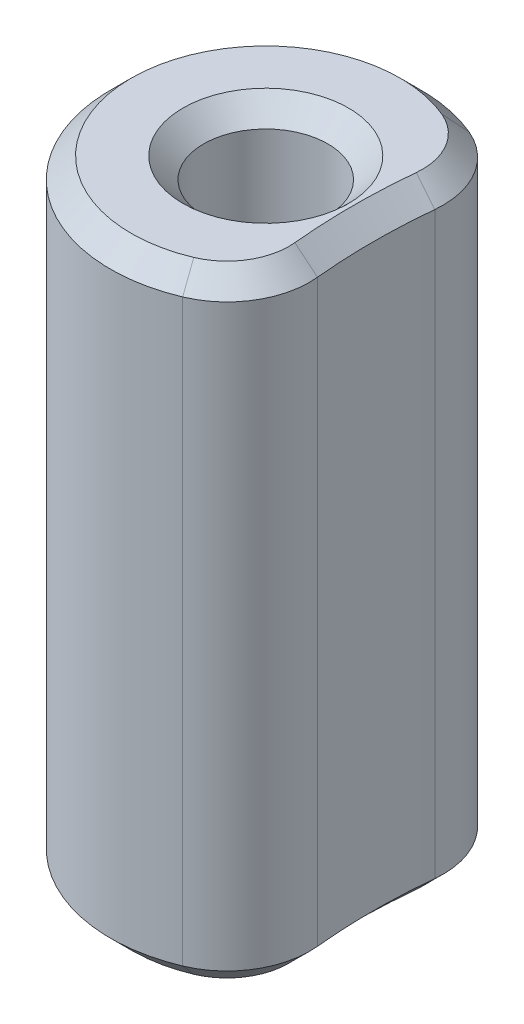
ISO-10303-21;
HEADER;
FILE_DESCRIPTION(('STEP AP214'),'2;1');
FILE_NAME('part.step','',(''),(''),'','','');
FILE_SCHEMA(('AUTOMOTIVE_DESIGN { 1 0 10303 214 1 1 1 1 }'));
ENDSEC;
DATA;
#1=APPLICATION_CONTEXT('core data for automotive mechanical design processes');
#2=APPLICATION_PROTOCOL_DEFINITION('international standard','automotive_design',2000,#1);
#3=PRODUCT_CONTEXT('',#1,'mechanical');
#4=PRODUCT('Part','Part','',(#3));
#5=PRODUCT_RELATED_PRODUCT_CATEGORY('part','',(#4));
#6=PRODUCT_DEFINITION_FORMATION('','',#4);
#7=PRODUCT_DEFINITION_CONTEXT('part definition',#1,'design');
#8=PRODUCT_DEFINITION('design','',#6,#7);
#9=PRODUCT_DEFINITION_SHAPE('','',#8);
#10=(LENGTH_UNIT() NAMED_UNIT(*) SI_UNIT(.MILLI.,.METRE.));
#11=(NAMED_UNIT(*) PLANE_ANGLE_UNIT() SI_UNIT($,.RADIAN.));
#12=(NAMED_UNIT(*) SI_UNIT($,.STERADIAN.) SOLID_ANGLE_UNIT());
#13=UNCERTAINTY_MEASURE_WITH_UNIT(LENGTH_MEASURE(1.E-05),#10,'distance_accuracy_value','');
#14=(GEOMETRIC_REPRESENTATION_CONTEXT(3) GLOBAL_UNCERTAINTY_ASSIGNED_CONTEXT((#13)) GLOBAL_UNIT_ASSIGNED_CONTEXT((#10,
#11,#12)) REPRESENTATION_CONTEXT('',''));
#15=CARTESIAN_POINT('',(0.,0.,0.));
#16=DIRECTION('',(0.,0.,1.));
#17=DIRECTION('',(1.,0.,0.));
#18=AXIS2_PLACEMENT_3D('',#15,#16,#17);
#19=CARTESIAN_POINT('',(10.776307345283,9.525,0.));
#20=DIRECTION('',(0.,1.,0.));
#21=DIRECTION('',(0.,0.,1.));
#22=AXIS2_PLACEMENT_3D('',#19,#20,#21);
#23=PLANE('',#22);
#24=CARTESIAN_POINT('',(0.,9.525,0.));
#25=DIRECTION('',(0.,1.,0.));
#26=DIRECTION('',(0.,0.,1.));
#27=AXIS2_PLACEMENT_3D('',#24,#25,#26);
#28=CIRCLE('',#27,2.54000000000001);
#29=CARTESIAN_POINT('',(0.,9.525,2.54000000000001));
#30=VERTEX_POINT('',#29);
#31=EDGE_CURVE('E11',#30,#30,#28,.F.);
#32=ORIENTED_EDGE('',*,*,#31,.T.);
#33=EDGE_LOOP('',(#32));
#34=FACE_BOUND('',#33,.T.);
#35=CARTESIAN_POINT('',(0.,9.525,0.));
#36=DIRECTION('',(0.,1.,0.));
#37=DIRECTION('',(0.,0.,1.));
#38=AXIS2_PLACEMENT_3D('',#35,#36,#37);
#39=CIRCLE('',#38,4.12750000000001);
#40=CARTESIAN_POINT('',(1.59687457272017,9.525,-3.80608037868354));
#41=VERTEX_POINT('',#40);
#42=CARTESIAN_POINT('',(1.59687457272017,9.525,3.80608037868354));
#43=VERTEX_POINT('',#42);
#44=EDGE_CURVE('E60',#41,#43,#39,.T.);
#45=ORIENTED_EDGE('',*,*,#44,.T.);
#46=CARTESIAN_POINT('',(0.85985553915701,9.525,2.04942789621421));
#47=DIRECTION('',(0.,1.,0.));
#48=DIRECTION('',(0.,0.,1.));
#49=AXIS2_PLACEMENT_3D('',#46,#47,#48);
#50=CIRCLE('',#49,1.90500000000001);
#51=CARTESIAN_POINT('',(2.75558056481029,9.525,1.86167372951766));
#52=VERTEX_POINT('',#51);
#53=EDGE_CURVE('E52',#43,#52,#50,.T.);
#54=ORIENTED_EDGE('',*,*,#53,.T.);
#55=CARTESIAN_POINT('',(21.552614690566,9.525,0.));
#56=DIRECTION('',(0.,1.,0.));
#57=DIRECTION('',(0.,0.,1.));
#58=AXIS2_PLACEMENT_3D('',#55,#56,#57);
#59=CIRCLE('',#58,18.889);
#60=CARTESIAN_POINT('',(2.75558056481029,9.525,-1.86167372951766));
#61=VERTEX_POINT('',#60);
#62=EDGE_CURVE('E180',#52,#61,#59,.F.);
#63=ORIENTED_EDGE('',*,*,#62,.T.);
#64=CARTESIAN_POINT('',(0.85985553915701,9.525,-2.04942789621421));
#65=DIRECTION('',(0.,1.,0.));
#66=DIRECTION('',(0.,0.,1.));
#67=AXIS2_PLACEMENT_3D('',#64,#65,#66);
#68=CIRCLE('',#67,1.90500000000001);
#69=EDGE_CURVE('E65',#61,#41,#68,.T.);
#70=ORIENTED_EDGE('',*,*,#69,.T.);
#71=EDGE_LOOP('',(#45,#54,#63,#70));
#72=FACE_BOUND('',#71,.T.);
#73=ADVANCED_FACE('F41',(#34,#72),#23,.T.);
#74=CARTESIAN_POINT('',(10.776307345283,-9.525,0.));
#75=DIRECTION('',(0.,1.,0.));
#76=DIRECTION('',(0.,0.,1.));
#77=AXIS2_PLACEMENT_3D('',#74,#75,#76);
#78=PLANE('',#77);
#79=CARTESIAN_POINT('',(0.,-9.525,0.));
#80=DIRECTION('',(0.,1.,0.));
#81=DIRECTION('',(0.,0.,1.));
#82=AXIS2_PLACEMENT_3D('',#79,#80,#81);
#83=CIRCLE('',#82,2.53999999999999);
#84=CARTESIAN_POINT('',(0.,-9.525,2.53999999999999));
#85=VERTEX_POINT('',#84);
#86=EDGE_CURVE('E139',#85,#85,#83,.T.);
#87=ORIENTED_EDGE('',*,*,#86,.T.);
#88=EDGE_LOOP('',(#87));
#89=FACE_BOUND('',#88,.T.);
#90=CARTESIAN_POINT('',(21.552614690566,-9.525,0.));
#91=DIRECTION('',(0.,1.,0.));
#92=DIRECTION('',(0.,0.,1.));
#93=AXIS2_PLACEMENT_3D('',#90,#91,#92);
#94=CIRCLE('',#93,18.889);
#95=CARTESIAN_POINT('',(2.75558056481026,-9.525,-1.86167372951766));
#96=VERTEX_POINT('',#95);
#97=CARTESIAN_POINT('',(2.75558056481026,-9.525,1.86167372951766));
#98=VERTEX_POINT('',#97);
#99=EDGE_CURVE('E136',#96,#98,#94,.T.);
#100=ORIENTED_EDGE('',*,*,#99,.T.);
#101=CARTESIAN_POINT('',(0.85985553915701,-9.525,2.04942789621421));
#102=DIRECTION('',(0.,1.,0.));
#103=DIRECTION('',(0.,0.,1.));
#104=AXIS2_PLACEMENT_3D('',#101,#102,#103);
#105=CIRCLE('',#104,1.90499999999998);
#106=CARTESIAN_POINT('',(1.59687457272015,-9.525,3.80608037868351));
#107=VERTEX_POINT('',#106);
#108=EDGE_CURVE('E115',#98,#107,#105,.F.);
#109=ORIENTED_EDGE('',*,*,#108,.T.);
#110=CARTESIAN_POINT('',(0.,-9.525,0.));
#111=DIRECTION('',(0.,1.,0.));
#112=DIRECTION('',(0.,0.,1.));
#113=AXIS2_PLACEMENT_3D('',#110,#111,#112);
#114=CIRCLE('',#113,4.12749999999998);
#115=CARTESIAN_POINT('',(1.59687457272015,-9.525,-3.80608037868351));
#116=VERTEX_POINT('',#115);
#117=EDGE_CURVE('E124',#107,#116,#114,.F.);
#118=ORIENTED_EDGE('',*,*,#117,.T.);
#119=CARTESIAN_POINT('',(0.85985553915701,-9.525,-2.04942789621421));
#120=DIRECTION('',(0.,1.,0.));
#121=DIRECTION('',(0.,0.,1.));
#122=AXIS2_PLACEMENT_3D('',#119,#120,#121);
#123=CIRCLE('',#122,1.90499999999998);
#124=EDGE_CURVE('E131',#116,#96,#123,.F.);
#125=ORIENTED_EDGE('',*,*,#124,.T.);
#126=EDGE_LOOP('',(#100,#109,#118,#125));
#127=FACE_BOUND('',#126,.T.);
#128=ADVANCED_FACE('F134',(#89,#127),#78,.F.);
#129=CARTESIAN_POINT('',(0.,9.525,0.));
#130=DIRECTION('',(0.,-1.,0.));
#131=DIRECTION('',(0.,0.,-1.));
#132=AXIS2_PLACEMENT_3D('',#129,#130,#131);
#133=CYLINDRICAL_SURFACE('',#132,4.7625);
#134=DIRECTION('',(0.,-1.,0.));
#135=VECTOR('',#134,1.);
#136=CARTESIAN_POINT('',(1.84254758390788,9.525,-4.39163120617331));
#137=LINE('',#136,#135);
#138=CARTESIAN_POINT('',(1.84254758390788,8.89000000000001,-4.39163120617331));
#139=VERTEX_POINT('',#138);
#140=CARTESIAN_POINT('',(1.84254758390788,-8.88999999999997,-4.39163120617331));
#141=VERTEX_POINT('',#140);
#142=EDGE_CURVE('E224',#139,#141,#137,.T.);
#143=ORIENTED_EDGE('',*,*,#142,.T.);
#144=CARTESIAN_POINT('',(0.,-8.88999999999998,0.));
#145=DIRECTION('',(0.,1.,0.));
#146=DIRECTION('',(0.,0.,1.));
#147=AXIS2_PLACEMENT_3D('',#144,#145,#146);
#148=CIRCLE('',#147,4.7625);
#149=CARTESIAN_POINT('',(1.84254758390788,-8.88999999999997,4.39163120617331));
#150=VERTEX_POINT('',#149);
#151=EDGE_CURVE('E177',#141,#150,#148,.T.);
#152=ORIENTED_EDGE('',*,*,#151,.T.);
#153=DIRECTION('',(0.,-1.,0.));
#154=VECTOR('',#153,1.);
#155=CARTESIAN_POINT('',(1.84254758390788,9.525,4.39163120617331));
#156=LINE('',#155,#154);
#157=CARTESIAN_POINT('',(1.84254758390788,8.89000000000001,4.39163120617331));
#158=VERTEX_POINT('',#157);
#159=EDGE_CURVE('E197',#150,#158,#156,.F.);
#160=ORIENTED_EDGE('',*,*,#159,.T.);
#161=CARTESIAN_POINT('',(0.,8.89000000000001,0.));
#162=DIRECTION('',(0.,1.,0.));
#163=DIRECTION('',(0.,0.,1.));
#164=AXIS2_PLACEMENT_3D('',#161,#162,#163);
#165=CIRCLE('',#164,4.7625);
#166=EDGE_CURVE('E174',#158,#139,#165,.F.);
#167=ORIENTED_EDGE('',*,*,#166,.T.);
#168=EDGE_LOOP('',(#143,#152,#160,#167));
#169=FACE_BOUND('',#168,.T.);
#170=ADVANCED_FACE('F251',(#169),#133,.T.);
#171=CARTESIAN_POINT('',(21.552614690566,9.525,0.));
#172=DIRECTION('',(0.,-1.,0.));
#173=DIRECTION('',(0.,0.,-1.));
#174=AXIS2_PLACEMENT_3D('',#171,#172,#173);
#175=CYLINDRICAL_SURFACE('',#174,18.254);
#176=DIRECTION('',(0.,-1.,0.));
#177=VECTOR('',#176,1.);
#178=CARTESIAN_POINT('',(3.3874889066947,9.525,1.79908900728548));
#179=LINE('',#178,#177);
#180=CARTESIAN_POINT('',(3.3874889066947,8.89000000000001,1.79908900728548));
#181=VERTEX_POINT('',#180);
#182=CARTESIAN_POINT('',(3.3874889066947,-8.88999999999997,1.79908900728548));
#183=VERTEX_POINT('',#182);
#184=EDGE_CURVE('E231',#181,#183,#179,.T.);
#185=ORIENTED_EDGE('',*,*,#184,.T.);
#186=CARTESIAN_POINT('',(21.552614690566,-8.88999999999998,0.));
#187=DIRECTION('',(0.,1.,0.));
#188=DIRECTION('',(0.,0.,1.));
#189=AXIS2_PLACEMENT_3D('',#186,#187,#188);
#190=CIRCLE('',#189,18.254);
#191=CARTESIAN_POINT('',(3.3874889066947,-8.88999999999997,-1.79908900728548));
#192=VERTEX_POINT('',#191);
#193=EDGE_CURVE('E165',#183,#192,#190,.F.);
#194=ORIENTED_EDGE('',*,*,#193,.T.);
#195=DIRECTION('',(0.,-1.,0.));
#196=VECTOR('',#195,1.);
#197=CARTESIAN_POINT('',(3.3874889066947,9.525,-1.79908900728548));
#198=LINE('',#197,#196);
#199=CARTESIAN_POINT('',(3.3874889066947,8.89000000000001,-1.79908900728548));
#200=VERTEX_POINT('',#199);
#201=EDGE_CURVE('E132',#192,#200,#198,.F.);
#202=ORIENTED_EDGE('',*,*,#201,.T.);
#203=CARTESIAN_POINT('',(21.552614690566,8.89000000000001,0.));
#204=DIRECTION('',(0.,1.,0.));
#205=DIRECTION('',(0.,0.,1.));
#206=AXIS2_PLACEMENT_3D('',#203,#204,#205);
#207=CIRCLE('',#206,18.254);
#208=EDGE_CURVE('E162',#200,#181,#207,.T.);
#209=ORIENTED_EDGE('',*,*,#208,.T.);
#210=EDGE_LOOP('',(#185,#194,#202,#209));
#211=FACE_BOUND('',#210,.T.);
#212=ADVANCED_FACE('F227',(#211),#175,.F.);
#213=CARTESIAN_POINT('',(0.,9.525,0.));
#214=DIRECTION('',(0.,-1.,0.));
#215=DIRECTION('',(0.,0.,-1.));
#216=AXIS2_PLACEMENT_3D('',#213,#214,#215);
#217=CYLINDRICAL_SURFACE('',#216,1.905);
#218=CARTESIAN_POINT('',(0.,-8.89,0.));
#219=DIRECTION('',(0.,1.,0.));
#220=DIRECTION('',(0.,0.,1.));
#221=AXIS2_PLACEMENT_3D('',#218,#219,#220);
#222=CIRCLE('',#221,1.905);
#223=CARTESIAN_POINT('',(0.,-8.89,1.905));
#224=VERTEX_POINT('',#223);
#225=EDGE_CURVE('E152',#224,#224,#222,.F.);
#226=ORIENTED_EDGE('',*,*,#225,.T.);
#227=EDGE_LOOP('',(#226));
#228=FACE_BOUND('',#227,.T.);
#229=CARTESIAN_POINT('',(0.,8.88999999999999,0.));
#230=DIRECTION('',(0.,1.,0.));
#231=DIRECTION('',(0.,0.,1.));
#232=AXIS2_PLACEMENT_3D('',#229,#230,#231);
#233=CIRCLE('',#232,1.905);
#234=CARTESIAN_POINT('',(0.,8.88999999999999,1.905));
#235=VERTEX_POINT('',#234);
#236=EDGE_CURVE('E144',#235,#235,#233,.T.);
#237=ORIENTED_EDGE('',*,*,#236,.T.);
#238=EDGE_LOOP('',(#237));
#239=FACE_BOUND('',#238,.T.);
#240=ADVANCED_FACE('F258',(#228,#239),#217,.F.);
#241=CARTESIAN_POINT('',(0.85985553915701,9.525,-2.04942789621421));
#242=DIRECTION('',(0.,1.,0.));
#243=DIRECTION('',(0.,0.,1.));
#244=AXIS2_PLACEMENT_3D('',#241,#242,#243);
#245=CYLINDRICAL_SURFACE('',#244,2.54);
#246=ORIENTED_EDGE('',*,*,#201,.F.);
#247=CARTESIAN_POINT('',(0.85985553915701,-8.88999999999998,-2.04942789621421));
#248=DIRECTION('',(0.,1.,0.));
#249=DIRECTION('',(0.,0.,1.));
#250=AXIS2_PLACEMENT_3D('',#247,#248,#249);
#251=CIRCLE('',#250,2.54);
#252=EDGE_CURVE('E171',#192,#141,#251,.T.);
#253=ORIENTED_EDGE('',*,*,#252,.T.);
#254=ORIENTED_EDGE('',*,*,#142,.F.);
#255=CARTESIAN_POINT('',(0.85985553915701,8.89000000000001,-2.04942789621421));
#256=DIRECTION('',(0.,1.,0.));
#257=DIRECTION('',(0.,0.,1.));
#258=AXIS2_PLACEMENT_3D('',#255,#256,#257);
#259=CIRCLE('',#258,2.54);
#260=EDGE_CURVE('E168',#139,#200,#259,.F.);
#261=ORIENTED_EDGE('',*,*,#260,.T.);
#262=EDGE_LOOP('',(#246,#253,#254,#261));
#263=FACE_BOUND('',#262,.T.);
#264=ADVANCED_FACE('F221',(#263),#245,.T.);
#265=CARTESIAN_POINT('',(0.85985553915701,9.525,2.04942789621421));
#266=DIRECTION('',(0.,1.,0.));
#267=DIRECTION('',(0.,0.,1.));
#268=AXIS2_PLACEMENT_3D('',#265,#266,#267);
#269=CYLINDRICAL_SURFACE('',#268,2.54);
#270=ORIENTED_EDGE('',*,*,#159,.F.);
#271=CARTESIAN_POINT('',(0.85985553915701,-8.88999999999998,2.04942789621421));
#272=DIRECTION('',(0.,1.,0.));
#273=DIRECTION('',(0.,0.,1.));
#274=AXIS2_PLACEMENT_3D('',#271,#272,#273);
#275=CIRCLE('',#274,2.54);
#276=EDGE_CURVE('E117',#150,#183,#275,.T.);
#277=ORIENTED_EDGE('',*,*,#276,.T.);
#278=ORIENTED_EDGE('',*,*,#184,.F.);
#279=CARTESIAN_POINT('',(0.85985553915701,8.89000000000001,2.04942789621421));
#280=DIRECTION('',(0.,1.,0.));
#281=DIRECTION('',(0.,0.,1.));
#282=AXIS2_PLACEMENT_3D('',#279,#280,#281);
#283=CIRCLE('',#282,2.54);
#284=EDGE_CURVE('E156',#181,#158,#283,.F.);
#285=ORIENTED_EDGE('',*,*,#284,.T.);
#286=EDGE_LOOP('',(#270,#277,#278,#285));
#287=FACE_BOUND('',#286,.T.);
#288=ADVANCED_FACE('F244',(#287),#269,.T.);
#289=CARTESIAN_POINT('',(0.,-9.525,0.));
#290=DIRECTION('',(0.,-1.,0.));
#291=DIRECTION('',(0.,0.,-1.));
#292=AXIS2_PLACEMENT_3D('',#289,#290,#291);
#293=CONICAL_SURFACE('',#292,2.53999999999999,0.785398163397443);
#294=ORIENTED_EDGE('',*,*,#225,.F.);
#295=EDGE_LOOP('',(#294));
#296=FACE_BOUND('',#295,.T.);
#297=ORIENTED_EDGE('',*,*,#86,.F.);
#298=EDGE_LOOP('',(#297));
#299=FACE_BOUND('',#298,.T.);
#300=ADVANCED_FACE('F364',(#296,#299),#293,.F.);
#301=CARTESIAN_POINT('',(0.85985553915701,-9.525,-2.04942789621421));
#302=DIRECTION('',(0.,1.,0.));
#303=DIRECTION('',(0.,0.,1.));
#304=AXIS2_PLACEMENT_3D('',#301,#302,#303);
#305=CONICAL_SURFACE('',#304,1.90499999999998,0.785398163397449);
#306=DIRECTION('',(-0.273570160890321,-0.707106781186547,0.652042458027424));
#307=VECTOR('',#306,1.);
#308=CARTESIAN_POINT('',(1.84254758390788,-8.88999999999998,-4.39163120617331));
#309=LINE('',#308,#307);
#310=EDGE_CURVE('E127',#141,#116,#309,.T.);
#311=ORIENTED_EDGE('',*,*,#310,.F.);
#312=ORIENTED_EDGE('',*,*,#252,.F.);
#313=DIRECTION('',(0.703664052968225,0.707106781186547,0.0696914669118952));
#314=VECTOR('',#313,1.);
#315=CARTESIAN_POINT('',(2.75558056481026,-9.525,-1.86167372951766));
#316=LINE('',#315,#314);
#317=EDGE_CURVE('E193',#96,#192,#316,.T.);
#318=ORIENTED_EDGE('',*,*,#317,.F.);
#319=ORIENTED_EDGE('',*,*,#124,.F.);
#320=EDGE_LOOP('',(#311,#312,#318,#319));
#321=FACE_BOUND('',#320,.T.);
#322=ADVANCED_FACE('F239',(#321),#305,.T.);
#323=CARTESIAN_POINT('',(21.552614690566,-8.88999999999998,0.));
#324=DIRECTION('',(0.,-1.,0.));
#325=DIRECTION('',(0.,0.,-1.));
#326=AXIS2_PLACEMENT_3D('',#323,#324,#325);
#327=CONICAL_SURFACE('',#326,18.254,0.785398163397448);
#328=ORIENTED_EDGE('',*,*,#317,.T.);
#329=ORIENTED_EDGE('',*,*,#193,.F.);
#330=DIRECTION('',(0.703664052968225,0.707106781186547,-0.0696914669118952));
#331=VECTOR('',#330,1.);
#332=CARTESIAN_POINT('',(2.75558056481026,-9.525,1.86167372951766));
#333=LINE('',#332,#331);
#334=EDGE_CURVE('E121',#98,#183,#333,.T.);
#335=ORIENTED_EDGE('',*,*,#334,.F.);
#336=ORIENTED_EDGE('',*,*,#99,.F.);
#337=EDGE_LOOP('',(#328,#329,#335,#336));
#338=FACE_BOUND('',#337,.T.);
#339=ADVANCED_FACE('F241',(#338),#327,.F.);
#340=CARTESIAN_POINT('',(0.,-8.88999999999998,0.));
#341=DIRECTION('',(0.,1.,0.));
#342=DIRECTION('',(0.,0.,1.));
#343=AXIS2_PLACEMENT_3D('',#340,#341,#342);
#344=CONICAL_SURFACE('',#343,4.7625,0.785398163397449);
#345=ORIENTED_EDGE('',*,*,#310,.T.);
#346=ORIENTED_EDGE('',*,*,#117,.F.);
#347=DIRECTION('',(-0.273570160890321,-0.707106781186547,-0.652042458027424));
#348=VECTOR('',#347,1.);
#349=CARTESIAN_POINT('',(1.84254758390788,-8.88999999999998,4.39163120617331));
#350=LINE('',#349,#348);
#351=EDGE_CURVE('E111',#150,#107,#350,.T.);
#352=ORIENTED_EDGE('',*,*,#351,.F.);
#353=ORIENTED_EDGE('',*,*,#151,.F.);
#354=EDGE_LOOP('',(#345,#346,#352,#353));
#355=FACE_BOUND('',#354,.T.);
#356=ADVANCED_FACE('F125',(#355),#344,.T.);
#357=CARTESIAN_POINT('',(0.85985553915701,-9.525,2.04942789621421));
#358=DIRECTION('',(0.,1.,0.));
#359=DIRECTION('',(0.,0.,1.));
#360=AXIS2_PLACEMENT_3D('',#357,#358,#359);
#361=CONICAL_SURFACE('',#360,1.90499999999998,0.785398163397449);
#362=ORIENTED_EDGE('',*,*,#334,.T.);
#363=ORIENTED_EDGE('',*,*,#276,.F.);
#364=ORIENTED_EDGE('',*,*,#351,.T.);
#365=ORIENTED_EDGE('',*,*,#108,.F.);
#366=EDGE_LOOP('',(#362,#363,#364,#365));
#367=FACE_BOUND('',#366,.T.);
#368=ADVANCED_FACE('F113',(#367),#361,.T.);
#369=CARTESIAN_POINT('',(0.,8.88999999999999,0.));
#370=DIRECTION('',(0.,1.,0.));
#371=DIRECTION('',(0.,0.,1.));
#372=AXIS2_PLACEMENT_3D('',#369,#370,#371);
#373=CONICAL_SURFACE('',#372,1.905,0.785398163397451);
#374=ORIENTED_EDGE('',*,*,#31,.F.);
#375=EDGE_LOOP('',(#374));
#376=FACE_BOUND('',#375,.T.);
#377=ORIENTED_EDGE('',*,*,#236,.F.);
#378=EDGE_LOOP('',(#377));
#379=FACE_BOUND('',#378,.T.);
#380=ADVANCED_FACE('F278',(#376,#379),#373,.F.);
#381=CARTESIAN_POINT('',(0.85985553915701,9.525,-2.04942789621421));
#382=DIRECTION('',(0.,-1.,0.));
#383=DIRECTION('',(0.,0.,-1.));
#384=AXIS2_PLACEMENT_3D('',#381,#382,#383);
#385=CONICAL_SURFACE('',#384,1.90500000000001,0.785398163397445);
#386=DIRECTION('',(-0.703664052968223,0.70710678118655,-0.0696914669118951));
#387=VECTOR('',#386,1.);
#388=CARTESIAN_POINT('',(3.3874889066947,8.89000000000001,-1.79908900728548));
#389=LINE('',#388,#387);
#390=EDGE_CURVE('E203',#200,#61,#389,.T.);
#391=ORIENTED_EDGE('',*,*,#390,.F.);
#392=ORIENTED_EDGE('',*,*,#260,.F.);
#393=DIRECTION('',(0.27357016089032,-0.707106781186549,-0.652042458027422));
#394=VECTOR('',#393,1.);
#395=CARTESIAN_POINT('',(1.59687457272017,9.525,-3.80608037868354));
#396=LINE('',#395,#394);
#397=EDGE_CURVE('E46',#41,#139,#396,.T.);
#398=ORIENTED_EDGE('',*,*,#397,.F.);
#399=ORIENTED_EDGE('',*,*,#69,.F.);
#400=EDGE_LOOP('',(#391,#392,#398,#399));
#401=FACE_BOUND('',#400,.T.);
#402=ADVANCED_FACE('F44',(#401),#385,.T.);
#403=CARTESIAN_POINT('',(0.,9.525,0.));
#404=DIRECTION('',(0.,-1.,0.));
#405=DIRECTION('',(0.,0.,-1.));
#406=AXIS2_PLACEMENT_3D('',#403,#404,#405);
#407=CONICAL_SURFACE('',#406,4.12750000000001,0.785398163397445);
#408=ORIENTED_EDGE('',*,*,#397,.T.);
#409=ORIENTED_EDGE('',*,*,#166,.F.);
#410=DIRECTION('',(0.27357016089032,-0.70710678118655,0.652042458027421));
#411=VECTOR('',#410,1.);
#412=CARTESIAN_POINT('',(1.59687457272017,9.525,3.80608037868354));
#413=LINE('',#412,#411);
#414=EDGE_CURVE('E201',#43,#158,#413,.T.);
#415=ORIENTED_EDGE('',*,*,#414,.F.);
#416=ORIENTED_EDGE('',*,*,#44,.F.);
#417=EDGE_LOOP('',(#408,#409,#415,#416));
#418=FACE_BOUND('',#417,.T.);
#419=ADVANCED_FACE('F214',(#418),#407,.T.);
#420=CARTESIAN_POINT('',(21.552614690566,9.525,0.));
#421=DIRECTION('',(0.,1.,0.));
#422=DIRECTION('',(0.,0.,1.));
#423=AXIS2_PLACEMENT_3D('',#420,#421,#422);
#424=CONICAL_SURFACE('',#423,18.889,0.785398163397446);
#425=ORIENTED_EDGE('',*,*,#390,.T.);
#426=ORIENTED_EDGE('',*,*,#62,.F.);
#427=DIRECTION('',(-0.703664052968223,0.70710678118655,0.0696914669118951));
#428=VECTOR('',#427,1.);
#429=CARTESIAN_POINT('',(3.3874889066947,8.89000000000001,1.79908900728548));
#430=LINE('',#429,#428);
#431=EDGE_CURVE('E198',#181,#52,#430,.T.);
#432=ORIENTED_EDGE('',*,*,#431,.F.);
#433=ORIENTED_EDGE('',*,*,#208,.F.);
#434=EDGE_LOOP('',(#425,#426,#432,#433));
#435=FACE_BOUND('',#434,.T.);
#436=ADVANCED_FACE('F303',(#435),#424,.F.);
#437=CARTESIAN_POINT('',(0.85985553915701,9.525,2.04942789621421));
#438=DIRECTION('',(0.,-1.,0.));
#439=DIRECTION('',(0.,0.,-1.));
#440=AXIS2_PLACEMENT_3D('',#437,#438,#439);
#441=CONICAL_SURFACE('',#440,1.90500000000001,0.785398163397446);
#442=ORIENTED_EDGE('',*,*,#414,.T.);
#443=ORIENTED_EDGE('',*,*,#284,.F.);
#444=ORIENTED_EDGE('',*,*,#431,.T.);
#445=ORIENTED_EDGE('',*,*,#53,.F.);
#446=EDGE_LOOP('',(#442,#443,#444,#445));
#447=FACE_BOUND('',#446,.T.);
#448=ADVANCED_FACE('F297',(#447),#441,.T.);
#449=CLOSED_SHELL('',(#73,#128,#170,#212,#240,#264,#288,#300,#322,#339,#356,#368,#380,#402,#419,
#436,#448));
#450=MANIFOLD_SOLID_BREP('B2',#449);
#451=ADVANCED_BREP_SHAPE_REPRESENTATION('',(#18,#450),#14);
#452=SHAPE_DEFINITION_REPRESENTATION(#9,#451);
ENDSEC;
END-ISO-10303-21;
